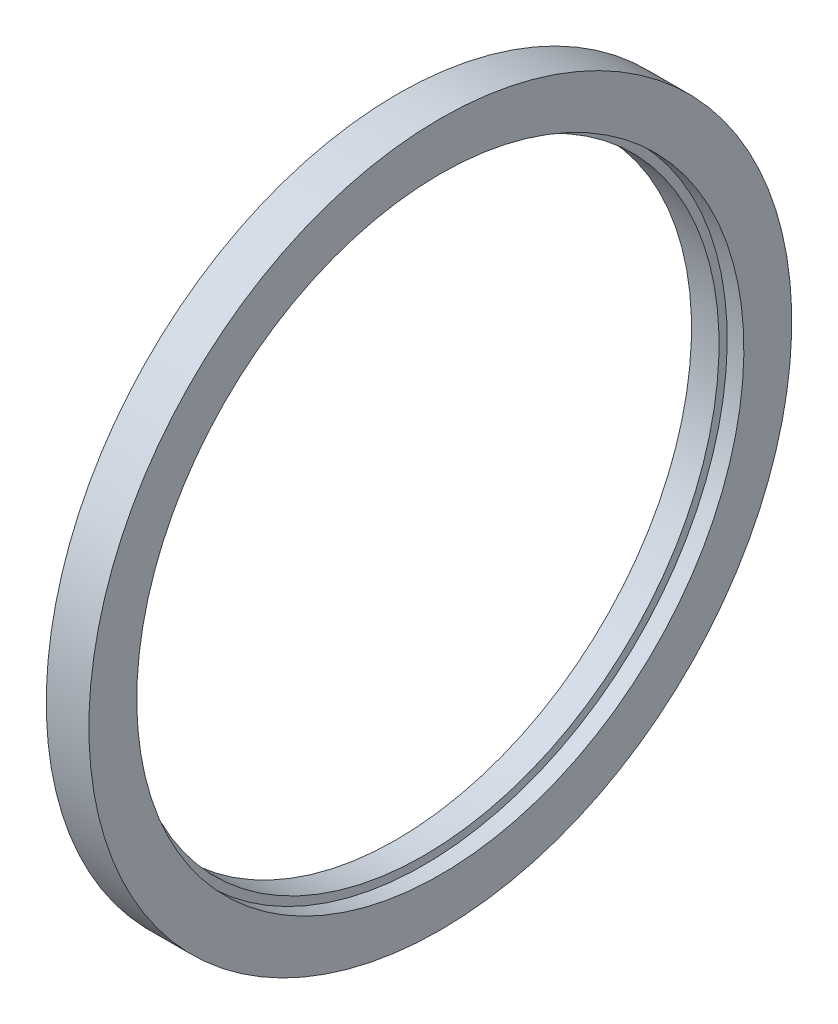
ISO-10303-21;
HEADER;
FILE_DESCRIPTION(('STEP AP214'),'2;1');
FILE_NAME('part.step','',(''),(''),'','','');
FILE_SCHEMA(('AUTOMOTIVE_DESIGN { 1 0 10303 214 1 1 1 1 }'));
ENDSEC;
DATA;
#1=APPLICATION_CONTEXT('core data for automotive mechanical design processes');
#2=APPLICATION_PROTOCOL_DEFINITION('international standard','automotive_design',2000,#1);
#3=PRODUCT_CONTEXT('',#1,'mechanical');
#4=PRODUCT('Part','Part','',(#3));
#5=PRODUCT_RELATED_PRODUCT_CATEGORY('part','',(#4));
#6=PRODUCT_DEFINITION_FORMATION('','',#4);
#7=PRODUCT_DEFINITION_CONTEXT('part definition',#1,'design');
#8=PRODUCT_DEFINITION('design','',#6,#7);
#9=PRODUCT_DEFINITION_SHAPE('','',#8);
#10=(LENGTH_UNIT() NAMED_UNIT(*) SI_UNIT(.MILLI.,.METRE.));
#11=(NAMED_UNIT(*) PLANE_ANGLE_UNIT() SI_UNIT($,.RADIAN.));
#12=(NAMED_UNIT(*) SI_UNIT($,.STERADIAN.) SOLID_ANGLE_UNIT());
#13=UNCERTAINTY_MEASURE_WITH_UNIT(LENGTH_MEASURE(1.E-05),#10,'distance_accuracy_value','');
#14=(GEOMETRIC_REPRESENTATION_CONTEXT(3) GLOBAL_UNCERTAINTY_ASSIGNED_CONTEXT((#13)) GLOBAL_UNIT_ASSIGNED_CONTEXT((#10,
#11,#12)) REPRESENTATION_CONTEXT('',''));
#15=CARTESIAN_POINT('',(0.,0.,0.));
#16=DIRECTION('',(0.,0.,1.));
#17=DIRECTION('',(1.,0.,0.));
#18=AXIS2_PLACEMENT_3D('',#15,#16,#17);
#19=CARTESIAN_POINT('',(0.508000000000102,133.984999999999,0.));
#20=DIRECTION('',(-1.,0.,0.));
#21=DIRECTION('',(0.,0.,1.));
#22=AXIS2_PLACEMENT_3D('',#19,#20,#21);
#23=PLANE('',#22);
#24=CARTESIAN_POINT('',(0.508000000000117,0.,0.));
#25=DIRECTION('',(1.,0.,0.));
#26=DIRECTION('',(0.,1.,0.));
#27=AXIS2_PLACEMENT_3D('',#24,#25,#26);
#28=CIRCLE('',#27,123.825);
#29=CARTESIAN_POINT('',(0.508000000000102,123.825,0.));
#30=VERTEX_POINT('',#29);
#31=EDGE_CURVE('E39',#30,#30,#28,.T.);
#32=ORIENTED_EDGE('',*,*,#31,.T.);
#33=EDGE_LOOP('',(#32));
#34=FACE_BOUND('',#33,.T.);
#35=CARTESIAN_POINT('',(0.508000000000119,0.,0.));
#36=DIRECTION('',(1.,0.,0.));
#37=DIRECTION('',(0.,1.,0.));
#38=AXIS2_PLACEMENT_3D('',#35,#36,#37);
#39=CIRCLE('',#38,144.144999999998);
#40=CARTESIAN_POINT('',(0.508000000000102,144.144999999998,0.));
#41=VERTEX_POINT('',#40);
#42=EDGE_CURVE('E18',#41,#41,#39,.F.);
#43=ORIENTED_EDGE('',*,*,#42,.T.);
#44=EDGE_LOOP('',(#43));
#45=FACE_BOUND('',#44,.T.);
#46=ADVANCED_FACE('F15',(#34,#45),#23,.T.);
#47=CARTESIAN_POINT('',(0.254000000000076,0.,0.));
#48=DIRECTION('',(1.,0.,0.));
#49=DIRECTION('',(0.,1.,0.));
#50=AXIS2_PLACEMENT_3D('',#47,#48,#49);
#51=CYLINDRICAL_SURFACE('',#50,144.144999999998);
#52=ORIENTED_EDGE('',*,*,#42,.F.);
#53=EDGE_LOOP('',(#52));
#54=FACE_BOUND('',#53,.T.);
#55=CARTESIAN_POINT('',(-2.2161578128177E-09,0.,0.));
#56=DIRECTION('',(1.,0.,0.));
#57=DIRECTION('',(0.,1.,0.));
#58=AXIS2_PLACEMENT_3D('',#55,#56,#57);
#59=CIRCLE('',#58,144.145000000805);
#60=CARTESIAN_POINT('',(-2.21618112316441E-09,144.145000000805,0.));
#61=VERTEX_POINT('',#60);
#62=EDGE_CURVE('E38',#61,#61,#59,.T.);
#63=ORIENTED_EDGE('',*,*,#62,.F.);
#64=EDGE_LOOP('',(#63));
#65=FACE_BOUND('',#64,.T.);
#66=ADVANCED_FACE('F48',(#54,#65),#51,.F.);
#67=CARTESIAN_POINT('',(6.27380000000003,0.,0.));
#68=DIRECTION('',(1.,0.,0.));
#69=DIRECTION('',(0.,1.,0.));
#70=AXIS2_PLACEMENT_3D('',#67,#68,#69);
#71=CYLINDRICAL_SURFACE('',#70,123.825);
#72=CARTESIAN_POINT('',(12.0396,0.,0.));
#73=DIRECTION('',(1.,0.,0.));
#74=DIRECTION('',(0.,1.,0.));
#75=AXIS2_PLACEMENT_3D('',#72,#73,#74);
#76=CIRCLE('',#75,123.825);
#77=CARTESIAN_POINT('',(12.0395999999999,123.825,0.));
#78=VERTEX_POINT('',#77);
#79=EDGE_CURVE('E36',#78,#78,#76,.F.);
#80=ORIENTED_EDGE('',*,*,#79,.F.);
#81=EDGE_LOOP('',(#80));
#82=FACE_BOUND('',#81,.T.);
#83=ORIENTED_EDGE('',*,*,#31,.F.);
#84=EDGE_LOOP('',(#83));
#85=FACE_BOUND('',#84,.T.);
#86=ADVANCED_FACE('F51',(#82,#85),#71,.F.);
#87=CARTESIAN_POINT('',(1.15560549601207,0.,0.));
#88=DIRECTION('',(1.,0.,0.));
#89=DIRECTION('',(0.,1.,0.));
#90=AXIS2_PLACEMENT_3D('',#87,#88,#89);
#91=CONICAL_SURFACE('',#90,147.319999999193,1.22173047500001);
#92=ORIENTED_EDGE('',*,*,#62,.T.);
#93=EDGE_LOOP('',(#92));
#94=FACE_BOUND('',#93,.T.);
#95=CARTESIAN_POINT('',(1.15560549379589,0.,0.));
#96=DIRECTION('',(1.,0.,0.));
#97=DIRECTION('',(0.,1.,0.));
#98=AXIS2_PLACEMENT_3D('',#95,#96,#97);
#99=CIRCLE('',#98,147.32);
#100=CARTESIAN_POINT('',(1.15560549379587,147.32,0.));
#101=VERTEX_POINT('',#100);
#102=EDGE_CURVE('E35',#101,#101,#99,.T.);
#103=ORIENTED_EDGE('',*,*,#102,.F.);
#104=EDGE_LOOP('',(#103));
#105=FACE_BOUND('',#104,.T.);
#106=ADVANCED_FACE('F54',(#94,#105),#91,.T.);
#107=CARTESIAN_POINT('',(12.0395999999999,125.539499999999,0.));
#108=DIRECTION('',(1.,0.,0.));
#109=DIRECTION('',(0.,0.,-1.));
#110=AXIS2_PLACEMENT_3D('',#107,#108,#109);
#111=PLANE('',#110);
#112=ORIENTED_EDGE('',*,*,#79,.T.);
#113=EDGE_LOOP('',(#112));
#114=FACE_BOUND('',#113,.T.);
#115=CARTESIAN_POINT('',(12.0396,0.,0.));
#116=DIRECTION('',(1.,0.,0.));
#117=DIRECTION('',(0.,1.,0.));
#118=AXIS2_PLACEMENT_3D('',#115,#116,#117);
#119=CIRCLE('',#118,127.253999999999);
#120=CARTESIAN_POINT('',(12.0395999999999,127.253999999999,0.));
#121=VERTEX_POINT('',#120);
#122=EDGE_CURVE('E27',#121,#121,#119,.T.);
#123=ORIENTED_EDGE('',*,*,#122,.T.);
#124=EDGE_LOOP('',(#123));
#125=FACE_BOUND('',#124,.T.);
#126=ADVANCED_FACE('F57',(#114,#125),#111,.T.);
#127=CARTESIAN_POINT('',(10.0901027468978,0.,0.));
#128=DIRECTION('',(1.,0.,0.));
#129=DIRECTION('',(0.,1.,0.));
#130=AXIS2_PLACEMENT_3D('',#127,#128,#129);
#131=CYLINDRICAL_SURFACE('',#130,147.32);
#132=ORIENTED_EDGE('',*,*,#102,.T.);
#133=EDGE_LOOP('',(#132));
#134=FACE_BOUND('',#133,.T.);
#135=CARTESIAN_POINT('',(19.0245999999998,0.,0.));
#136=DIRECTION('',(1.,0.,0.));
#137=DIRECTION('',(0.,1.,0.));
#138=AXIS2_PLACEMENT_3D('',#135,#136,#137);
#139=CIRCLE('',#138,147.32);
#140=CARTESIAN_POINT('',(19.0245999999998,147.32,0.));
#141=VERTEX_POINT('',#140);
#142=EDGE_CURVE('E22',#141,#141,#139,.T.);
#143=ORIENTED_EDGE('',*,*,#142,.F.);
#144=EDGE_LOOP('',(#143));
#145=FACE_BOUND('',#144,.T.);
#146=ADVANCED_FACE('F65',(#134,#145),#131,.T.);
#147=CARTESIAN_POINT('',(15.5320999999999,0.,0.));
#148=DIRECTION('',(1.,0.,0.));
#149=DIRECTION('',(0.,1.,0.));
#150=AXIS2_PLACEMENT_3D('',#147,#148,#149);
#151=CYLINDRICAL_SURFACE('',#150,127.253999999999);
#152=CARTESIAN_POINT('',(19.0245999999999,0.,0.));
#153=DIRECTION('',(1.,0.,0.));
#154=DIRECTION('',(0.,1.,0.));
#155=AXIS2_PLACEMENT_3D('',#152,#153,#154);
#156=CIRCLE('',#155,127.253999999999);
#157=CARTESIAN_POINT('',(19.0245999999999,127.253999999999,0.));
#158=VERTEX_POINT('',#157);
#159=EDGE_CURVE('E10',#158,#158,#156,.F.);
#160=ORIENTED_EDGE('',*,*,#159,.F.);
#161=EDGE_LOOP('',(#160));
#162=FACE_BOUND('',#161,.T.);
#163=ORIENTED_EDGE('',*,*,#122,.F.);
#164=EDGE_LOOP('',(#163));
#165=FACE_BOUND('',#164,.T.);
#166=ADVANCED_FACE('F68',(#162,#165),#151,.F.);
#167=CARTESIAN_POINT('',(19.0245999999998,137.286999999999,0.));
#168=DIRECTION('',(1.,0.,0.));
#169=DIRECTION('',(0.,0.,-1.));
#170=AXIS2_PLACEMENT_3D('',#167,#168,#169);
#171=PLANE('',#170);
#172=ORIENTED_EDGE('',*,*,#159,.T.);
#173=EDGE_LOOP('',(#172));
#174=FACE_BOUND('',#173,.T.);
#175=ORIENTED_EDGE('',*,*,#142,.T.);
#176=EDGE_LOOP('',(#175));
#177=FACE_BOUND('',#176,.T.);
#178=ADVANCED_FACE('F72',(#174,#177),#171,.T.);
#179=CLOSED_SHELL('',(#46,#66,#86,#106,#126,#146,#166,#178));
#180=MANIFOLD_SOLID_BREP('B1',#179);
#181=ADVANCED_BREP_SHAPE_REPRESENTATION('',(#18,#180),#14);
#182=SHAPE_DEFINITION_REPRESENTATION(#9,#181);
ENDSEC;
END-ISO-10303-21;
